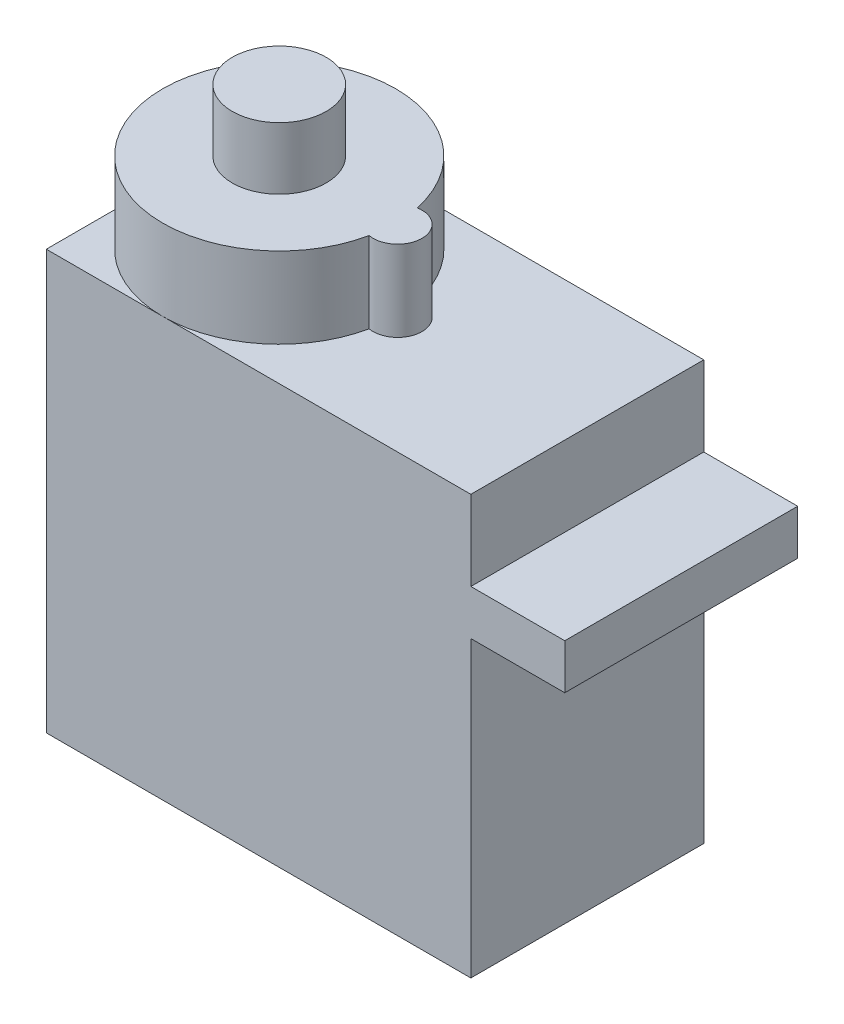
ISO-10303-21;
HEADER;
FILE_DESCRIPTION(('STEP AP214'),'2;1');
FILE_NAME('part.step','',(''),(''),'','','');
FILE_SCHEMA(('AUTOMOTIVE_DESIGN { 1 0 10303 214 1 1 1 1 }'));
ENDSEC;
DATA;
#1=APPLICATION_CONTEXT('core data for automotive mechanical design processes');
#2=APPLICATION_PROTOCOL_DEFINITION('international standard','automotive_design',2000,#1);
#3=PRODUCT_CONTEXT('',#1,'mechanical');
#4=PRODUCT('Part','Part','',(#3));
#5=PRODUCT_RELATED_PRODUCT_CATEGORY('part','',(#4));
#6=PRODUCT_DEFINITION_FORMATION('','',#4);
#7=PRODUCT_DEFINITION_CONTEXT('part definition',#1,'design');
#8=PRODUCT_DEFINITION('design','',#6,#7);
#9=PRODUCT_DEFINITION_SHAPE('','',#8);
#10=(LENGTH_UNIT() NAMED_UNIT(*) SI_UNIT(.MILLI.,.METRE.));
#11=(NAMED_UNIT(*) PLANE_ANGLE_UNIT() SI_UNIT($,.RADIAN.));
#12=(NAMED_UNIT(*) SI_UNIT($,.STERADIAN.) SOLID_ANGLE_UNIT());
#13=UNCERTAINTY_MEASURE_WITH_UNIT(LENGTH_MEASURE(1.E-05),#10,'distance_accuracy_value','');
#14=(GEOMETRIC_REPRESENTATION_CONTEXT(3) GLOBAL_UNCERTAINTY_ASSIGNED_CONTEXT((#13)) GLOBAL_UNIT_ASSIGNED_CONTEXT((#10,
#11,#12)) REPRESENTATION_CONTEXT('',''));
#15=CARTESIAN_POINT('',(0.,0.,0.));
#16=DIRECTION('',(0.,0.,1.));
#17=DIRECTION('',(1.,0.,0.));
#18=AXIS2_PLACEMENT_3D('',#15,#16,#17);
#19=CARTESIAN_POINT('',(0.,22.3,0.));
#20=DIRECTION('',(0.,-1.,0.));
#21=DIRECTION('',(0.,0.,-1.));
#22=AXIS2_PLACEMENT_3D('',#19,#20,#21);
#23=PLANE('',#22);
#24=CARTESIAN_POINT('',(1.2,22.3,0.));
#25=DIRECTION('',(0.,1.,0.));
#26=DIRECTION('',(0.,0.,1.));
#27=AXIS2_PLACEMENT_3D('',#24,#25,#26);
#28=CIRCLE('',#27,1.3);
#29=CARTESIAN_POINT('',(0.966666666666667,22.3,1.27888840621673));
#30=VERTEX_POINT('',#29);
#31=CARTESIAN_POINT('',(0.966666666666667,22.3,-1.27888840621673));
#32=VERTEX_POINT('',#31);
#33=EDGE_CURVE('E140',#30,#32,#28,.T.);
#34=ORIENTED_EDGE('',*,*,#33,.F.);
#35=CARTESIAN_POINT('',(-5.1,22.3,0.));
#36=DIRECTION('',(0.,1.,0.));
#37=DIRECTION('',(0.,0.,1.));
#38=AXIS2_PLACEMENT_3D('',#35,#36,#37);
#39=CIRCLE('',#38,6.2);
#40=CARTESIAN_POINT('',(-5.1,22.3,6.2));
#41=VERTEX_POINT('',#40);
#42=EDGE_CURVE('E60',#41,#30,#39,.T.);
#43=ORIENTED_EDGE('',*,*,#42,.F.);
#44=DIRECTION('',(1.,0.,0.));
#45=VECTOR('',#44,1.);
#46=CARTESIAN_POINT('',(-11.3,22.3,6.2));
#47=LINE('',#46,#45);
#48=CARTESIAN_POINT('',(11.3,22.3,6.2));
#49=VERTEX_POINT('',#48);
#50=EDGE_CURVE('E184',#41,#49,#47,.T.);
#51=ORIENTED_EDGE('',*,*,#50,.T.);
#52=DIRECTION('',(0.,0.,-1.));
#53=VECTOR('',#52,1.);
#54=CARTESIAN_POINT('',(11.3,22.3,6.2));
#55=LINE('',#54,#53);
#56=CARTESIAN_POINT('',(11.3,22.3,-6.2));
#57=VERTEX_POINT('',#56);
#58=EDGE_CURVE('E173',#49,#57,#55,.T.);
#59=ORIENTED_EDGE('',*,*,#58,.T.);
#60=DIRECTION('',(-1.,0.,0.));
#61=VECTOR('',#60,1.);
#62=CARTESIAN_POINT('',(-11.3,22.3,-6.2));
#63=LINE('',#62,#61);
#64=CARTESIAN_POINT('',(-5.1,22.3,-6.2));
#65=VERTEX_POINT('',#64);
#66=EDGE_CURVE('E178',#57,#65,#63,.T.);
#67=ORIENTED_EDGE('',*,*,#66,.T.);
#68=EDGE_CURVE('E54',#32,#65,#39,.T.);
#69=ORIENTED_EDGE('',*,*,#68,.F.);
#70=EDGE_LOOP('',(#34,#43,#51,#59,#67,#69));
#71=FACE_BOUND('',#70,.T.);
#72=ADVANCED_FACE('F37',(#71),#23,.F.);
#73=CARTESIAN_POINT('',(-11.3,22.3,0.));
#74=VERTEX_POINT('',#73);
#75=EDGE_CURVE('E46',#65,#74,#39,.T.);
#76=ORIENTED_EDGE('',*,*,#75,.F.);
#77=CARTESIAN_POINT('',(-11.3,22.3,-6.2));
#78=VERTEX_POINT('',#77);
#79=EDGE_CURVE('E176',#65,#78,#63,.T.);
#80=ORIENTED_EDGE('',*,*,#79,.T.);
#81=DIRECTION('',(0.,0.,1.));
#82=VECTOR('',#81,1.);
#83=CARTESIAN_POINT('',(-11.3,22.3,6.2));
#84=LINE('',#83,#82);
#85=EDGE_CURVE('E181',#78,#74,#84,.T.);
#86=ORIENTED_EDGE('',*,*,#85,.T.);
#87=EDGE_LOOP('',(#76,#80,#86));
#88=FACE_BOUND('',#87,.T.);
#89=ADVANCED_FACE('F220',(#88),#23,.F.);
#90=CARTESIAN_POINT('',(11.3,22.3,6.2));
#91=DIRECTION('',(-1.,0.,0.));
#92=DIRECTION('',(0.,0.,1.));
#93=AXIS2_PLACEMENT_3D('',#90,#91,#92);
#94=PLANE('',#93);
#95=DIRECTION('',(0.,0.,1.));
#96=VECTOR('',#95,1.);
#97=CARTESIAN_POINT('',(11.3,18.05,6.2));
#98=LINE('',#97,#96);
#99=CARTESIAN_POINT('',(11.3,18.05,-6.2));
#100=VERTEX_POINT('',#99);
#101=CARTESIAN_POINT('',(11.3,18.05,6.2));
#102=VERTEX_POINT('',#101);
#103=EDGE_CURVE('E144',#100,#102,#98,.T.);
#104=ORIENTED_EDGE('',*,*,#103,.F.);
#105=DIRECTION('',(0.,-1.,0.));
#106=VECTOR('',#105,1.);
#107=CARTESIAN_POINT('',(11.3,22.3,-6.2));
#108=LINE('',#107,#106);
#109=EDGE_CURVE('E41',#57,#100,#108,.T.);
#110=ORIENTED_EDGE('',*,*,#109,.F.);
#111=ORIENTED_EDGE('',*,*,#58,.F.);
#112=DIRECTION('',(0.,-1.,0.));
#113=VECTOR('',#112,1.);
#114=CARTESIAN_POINT('',(11.3,22.3,6.2));
#115=LINE('',#114,#113);
#116=EDGE_CURVE('E197',#49,#102,#115,.T.);
#117=ORIENTED_EDGE('',*,*,#116,.T.);
#118=EDGE_LOOP('',(#104,#110,#111,#117));
#119=FACE_BOUND('',#118,.T.);
#120=ADVANCED_FACE('F39',(#119),#94,.F.);
#121=DIRECTION('',(0.,0.,-1.));
#122=VECTOR('',#121,1.);
#123=CARTESIAN_POINT('',(11.3,15.65,6.2));
#124=LINE('',#123,#122);
#125=CARTESIAN_POINT('',(11.3,15.65,6.2));
#126=VERTEX_POINT('',#125);
#127=CARTESIAN_POINT('',(11.3,15.65,-6.2));
#128=VERTEX_POINT('',#127);
#129=EDGE_CURVE('E141',#126,#128,#124,.T.);
#130=ORIENTED_EDGE('',*,*,#129,.F.);
#131=CARTESIAN_POINT('',(11.3,0.,6.2));
#132=VERTEX_POINT('',#131);
#133=EDGE_CURVE('E188',#126,#132,#115,.T.);
#134=ORIENTED_EDGE('',*,*,#133,.T.);
#135=DIRECTION('',(0.,0.,-1.));
#136=VECTOR('',#135,1.);
#137=CARTESIAN_POINT('',(11.3,0.,6.2));
#138=LINE('',#137,#136);
#139=CARTESIAN_POINT('',(11.3,0.,-6.2));
#140=VERTEX_POINT('',#139);
#141=EDGE_CURVE('E172',#132,#140,#138,.T.);
#142=ORIENTED_EDGE('',*,*,#141,.T.);
#143=EDGE_CURVE('E203',#128,#140,#108,.T.);
#144=ORIENTED_EDGE('',*,*,#143,.F.);
#145=EDGE_LOOP('',(#130,#134,#142,#144));
#146=FACE_BOUND('',#145,.T.);
#147=ADVANCED_FACE('F241',(#146),#94,.F.);
#148=CARTESIAN_POINT('',(-11.3,22.3,-6.2));
#149=DIRECTION('',(0.,0.,1.));
#150=DIRECTION('',(1.,0.,0.));
#151=AXIS2_PLACEMENT_3D('',#148,#149,#150);
#152=PLANE('',#151);
#153=DIRECTION('',(-1.,0.,0.));
#154=VECTOR('',#153,1.);
#155=CARTESIAN_POINT('',(-11.3,0.,-6.2));
#156=LINE('',#155,#154);
#157=CARTESIAN_POINT('',(-11.3,0.,-6.2));
#158=VERTEX_POINT('',#157);
#159=EDGE_CURVE('E191',#140,#158,#156,.T.);
#160=ORIENTED_EDGE('',*,*,#159,.T.);
#161=DIRECTION('',(0.,-1.,0.));
#162=VECTOR('',#161,1.);
#163=CARTESIAN_POINT('',(-11.3,22.3,-6.2));
#164=LINE('',#163,#162);
#165=EDGE_CURVE('E201',#78,#158,#164,.T.);
#166=ORIENTED_EDGE('',*,*,#165,.F.);
#167=ORIENTED_EDGE('',*,*,#79,.F.);
#168=ORIENTED_EDGE('',*,*,#66,.F.);
#169=ORIENTED_EDGE('',*,*,#109,.T.);
#170=DIRECTION('',(-1.,0.,0.));
#171=VECTOR('',#170,1.);
#172=CARTESIAN_POINT('',(16.3,18.05,-6.2));
#173=LINE('',#172,#171);
#174=CARTESIAN_POINT('',(16.3,18.05,-6.2));
#175=VERTEX_POINT('',#174);
#176=EDGE_CURVE('E163',#175,#100,#173,.T.);
#177=ORIENTED_EDGE('',*,*,#176,.F.);
#178=DIRECTION('',(0.,1.,0.));
#179=VECTOR('',#178,1.);
#180=CARTESIAN_POINT('',(16.3,18.05,-6.2));
#181=LINE('',#180,#179);
#182=CARTESIAN_POINT('',(16.3,15.65,-6.2));
#183=VERTEX_POINT('',#182);
#184=EDGE_CURVE('E154',#183,#175,#181,.T.);
#185=ORIENTED_EDGE('',*,*,#184,.F.);
#186=DIRECTION('',(-1.,0.,0.));
#187=VECTOR('',#186,1.);
#188=CARTESIAN_POINT('',(16.3,15.65,-6.2));
#189=LINE('',#188,#187);
#190=EDGE_CURVE('E166',#183,#128,#189,.T.);
#191=ORIENTED_EDGE('',*,*,#190,.T.);
#192=ORIENTED_EDGE('',*,*,#143,.T.);
#193=EDGE_LOOP('',(#160,#166,#167,#168,#169,#177,#185,#191,#192));
#194=FACE_BOUND('',#193,.T.);
#195=ADVANCED_FACE('F221',(#194),#152,.F.);
#196=CARTESIAN_POINT('',(-11.3,22.3,6.2));
#197=DIRECTION('',(1.,0.,0.));
#198=DIRECTION('',(0.,0.,-1.));
#199=AXIS2_PLACEMENT_3D('',#196,#197,#198);
#200=PLANE('',#199);
#201=DIRECTION('',(0.,0.,1.));
#202=VECTOR('',#201,1.);
#203=CARTESIAN_POINT('',(-11.3,0.,6.2));
#204=LINE('',#203,#202);
#205=CARTESIAN_POINT('',(-11.3,0.,6.2));
#206=VERTEX_POINT('',#205);
#207=EDGE_CURVE('E193',#158,#206,#204,.T.);
#208=ORIENTED_EDGE('',*,*,#207,.T.);
#209=DIRECTION('',(0.,-1.,0.));
#210=VECTOR('',#209,1.);
#211=CARTESIAN_POINT('',(-11.3,22.3,6.2));
#212=LINE('',#211,#210);
#213=CARTESIAN_POINT('',(-11.3,22.3,6.2));
#214=VERTEX_POINT('',#213);
#215=EDGE_CURVE('E199',#214,#206,#212,.T.);
#216=ORIENTED_EDGE('',*,*,#215,.F.);
#217=EDGE_CURVE('E180',#74,#214,#84,.T.);
#218=ORIENTED_EDGE('',*,*,#217,.F.);
#219=ORIENTED_EDGE('',*,*,#85,.F.);
#220=ORIENTED_EDGE('',*,*,#165,.T.);
#221=EDGE_LOOP('',(#208,#216,#218,#219,#220));
#222=FACE_BOUND('',#221,.T.);
#223=ADVANCED_FACE('F248',(#222),#200,.F.);
#224=CARTESIAN_POINT('',(-11.3,22.3,6.2));
#225=DIRECTION('',(0.,0.,-1.));
#226=DIRECTION('',(-1.,0.,0.));
#227=AXIS2_PLACEMENT_3D('',#224,#225,#226);
#228=PLANE('',#227);
#229=DIRECTION('',(1.,0.,0.));
#230=VECTOR('',#229,1.);
#231=CARTESIAN_POINT('',(-11.3,0.,6.2));
#232=LINE('',#231,#230);
#233=EDGE_CURVE('E177',#206,#132,#232,.T.);
#234=ORIENTED_EDGE('',*,*,#233,.T.);
#235=ORIENTED_EDGE('',*,*,#133,.F.);
#236=DIRECTION('',(-1.,0.,0.));
#237=VECTOR('',#236,1.);
#238=CARTESIAN_POINT('',(16.3,15.65,6.2));
#239=LINE('',#238,#237);
#240=CARTESIAN_POINT('',(16.3,15.65,6.2));
#241=VERTEX_POINT('',#240);
#242=EDGE_CURVE('E169',#241,#126,#239,.T.);
#243=ORIENTED_EDGE('',*,*,#242,.F.);
#244=DIRECTION('',(0.,-1.,0.));
#245=VECTOR('',#244,1.);
#246=CARTESIAN_POINT('',(16.3,18.05,6.2));
#247=LINE('',#246,#245);
#248=CARTESIAN_POINT('',(16.3,18.05,6.2));
#249=VERTEX_POINT('',#248);
#250=EDGE_CURVE('E149',#249,#241,#247,.T.);
#251=ORIENTED_EDGE('',*,*,#250,.F.);
#252=DIRECTION('',(-1.,0.,0.));
#253=VECTOR('',#252,1.);
#254=CARTESIAN_POINT('',(16.3,18.05,6.2));
#255=LINE('',#254,#253);
#256=EDGE_CURVE('E157',#249,#102,#255,.T.);
#257=ORIENTED_EDGE('',*,*,#256,.T.);
#258=ORIENTED_EDGE('',*,*,#116,.F.);
#259=ORIENTED_EDGE('',*,*,#50,.F.);
#260=EDGE_CURVE('E185',#214,#41,#47,.T.);
#261=ORIENTED_EDGE('',*,*,#260,.F.);
#262=ORIENTED_EDGE('',*,*,#215,.T.);
#263=EDGE_LOOP('',(#234,#235,#243,#251,#257,#258,#259,#261,#262));
#264=FACE_BOUND('',#263,.T.);
#265=ADVANCED_FACE('F231',(#264),#228,.F.);
#266=EDGE_CURVE('E213',#74,#41,#39,.T.);
#267=ORIENTED_EDGE('',*,*,#266,.F.);
#268=ORIENTED_EDGE('',*,*,#217,.T.);
#269=ORIENTED_EDGE('',*,*,#260,.T.);
#270=EDGE_LOOP('',(#267,#268,#269));
#271=FACE_BOUND('',#270,.T.);
#272=ADVANCED_FACE('F251',(#271),#23,.F.);
#273=CARTESIAN_POINT('',(0.,0.,0.));
#274=DIRECTION('',(0.,-1.,0.));
#275=DIRECTION('',(0.,0.,-1.));
#276=AXIS2_PLACEMENT_3D('',#273,#274,#275);
#277=PLANE('',#276);
#278=ORIENTED_EDGE('',*,*,#141,.F.);
#279=ORIENTED_EDGE('',*,*,#233,.F.);
#280=ORIENTED_EDGE('',*,*,#207,.F.);
#281=ORIENTED_EDGE('',*,*,#159,.F.);
#282=EDGE_LOOP('',(#278,#279,#280,#281));
#283=FACE_BOUND('',#282,.T.);
#284=ADVANCED_FACE('F247',(#283),#277,.T.);
#285=CARTESIAN_POINT('',(16.3,15.65,6.2));
#286=DIRECTION('',(0.,1.,0.));
#287=DIRECTION('',(0.,0.,1.));
#288=AXIS2_PLACEMENT_3D('',#285,#286,#287);
#289=PLANE('',#288);
#290=ORIENTED_EDGE('',*,*,#129,.T.);
#291=ORIENTED_EDGE('',*,*,#190,.F.);
#292=DIRECTION('',(0.,0.,-1.));
#293=VECTOR('',#292,1.);
#294=CARTESIAN_POINT('',(16.3,15.65,6.2));
#295=LINE('',#294,#293);
#296=EDGE_CURVE('E152',#241,#183,#295,.T.);
#297=ORIENTED_EDGE('',*,*,#296,.F.);
#298=ORIENTED_EDGE('',*,*,#242,.T.);
#299=EDGE_LOOP('',(#290,#291,#297,#298));
#300=FACE_BOUND('',#299,.T.);
#301=ADVANCED_FACE('F239',(#300),#289,.F.);
#302=CARTESIAN_POINT('',(16.3,18.05,6.2));
#303=DIRECTION('',(0.,-1.,0.));
#304=DIRECTION('',(0.,0.,-1.));
#305=AXIS2_PLACEMENT_3D('',#302,#303,#304);
#306=PLANE('',#305);
#307=ORIENTED_EDGE('',*,*,#103,.T.);
#308=ORIENTED_EDGE('',*,*,#256,.F.);
#309=DIRECTION('',(0.,0.,1.));
#310=VECTOR('',#309,1.);
#311=CARTESIAN_POINT('',(16.3,18.05,6.2));
#312=LINE('',#311,#310);
#313=EDGE_CURVE('E156',#175,#249,#312,.T.);
#314=ORIENTED_EDGE('',*,*,#313,.F.);
#315=ORIENTED_EDGE('',*,*,#176,.T.);
#316=EDGE_LOOP('',(#307,#308,#314,#315));
#317=FACE_BOUND('',#316,.T.);
#318=ADVANCED_FACE('F227',(#317),#306,.F.);
#319=CARTESIAN_POINT('',(16.3,0.,0.));
#320=DIRECTION('',(1.,0.,0.));
#321=DIRECTION('',(0.,0.,-1.));
#322=AXIS2_PLACEMENT_3D('',#319,#320,#321);
#323=PLANE('',#322);
#324=ORIENTED_EDGE('',*,*,#250,.T.);
#325=ORIENTED_EDGE('',*,*,#296,.T.);
#326=ORIENTED_EDGE('',*,*,#184,.T.);
#327=ORIENTED_EDGE('',*,*,#313,.T.);
#328=EDGE_LOOP('',(#324,#325,#326,#327));
#329=FACE_BOUND('',#328,.T.);
#330=ADVANCED_FACE('F235',(#329),#323,.T.);
#331=CARTESIAN_POINT('',(1.2,26.6,0.));
#332=DIRECTION('',(0.,-1.,0.));
#333=DIRECTION('',(0.,0.,-1.));
#334=AXIS2_PLACEMENT_3D('',#331,#332,#333);
#335=CYLINDRICAL_SURFACE('',#334,1.3);
#336=ORIENTED_EDGE('',*,*,#33,.T.);
#337=DIRECTION('',(0.,-1.,0.));
#338=VECTOR('',#337,1.);
#339=CARTESIAN_POINT('',(0.966666666666667,26.6,-1.27888840621673));
#340=LINE('',#339,#338);
#341=CARTESIAN_POINT('',(0.966666666666667,26.6,-1.27888840621673));
#342=VERTEX_POINT('',#341);
#343=EDGE_CURVE('E128',#342,#32,#340,.T.);
#344=ORIENTED_EDGE('',*,*,#343,.F.);
#345=CARTESIAN_POINT('',(1.2,26.6,0.));
#346=DIRECTION('',(0.,1.,0.));
#347=DIRECTION('',(0.,0.,1.));
#348=AXIS2_PLACEMENT_3D('',#345,#346,#347);
#349=CIRCLE('',#348,1.3);
#350=CARTESIAN_POINT('',(0.966666666666667,26.6,1.27888840621673));
#351=VERTEX_POINT('',#350);
#352=EDGE_CURVE('E134',#351,#342,#349,.T.);
#353=ORIENTED_EDGE('',*,*,#352,.F.);
#354=DIRECTION('',(0.,-1.,0.));
#355=VECTOR('',#354,1.);
#356=CARTESIAN_POINT('',(0.966666666666667,26.6,1.27888840621673));
#357=LINE('',#356,#355);
#358=EDGE_CURVE('E131',#351,#30,#357,.T.);
#359=ORIENTED_EDGE('',*,*,#358,.T.);
#360=EDGE_LOOP('',(#336,#344,#353,#359));
#361=FACE_BOUND('',#360,.T.);
#362=ADVANCED_FACE('F139',(#361),#335,.T.);
#363=CARTESIAN_POINT('',(-5.1,26.6,0.));
#364=DIRECTION('',(0.,-1.,0.));
#365=DIRECTION('',(0.,0.,-1.));
#366=AXIS2_PLACEMENT_3D('',#363,#364,#365);
#367=CYLINDRICAL_SURFACE('',#366,6.2);
#368=ORIENTED_EDGE('',*,*,#68,.T.);
#369=ORIENTED_EDGE('',*,*,#75,.T.);
#370=ORIENTED_EDGE('',*,*,#266,.T.);
#371=ORIENTED_EDGE('',*,*,#42,.T.);
#372=ORIENTED_EDGE('',*,*,#358,.F.);
#373=CARTESIAN_POINT('',(-5.1,26.6,0.));
#374=DIRECTION('',(0.,1.,0.));
#375=DIRECTION('',(0.,0.,1.));
#376=AXIS2_PLACEMENT_3D('',#373,#374,#375);
#377=CIRCLE('',#376,6.2);
#378=EDGE_CURVE('E124',#342,#351,#377,.T.);
#379=ORIENTED_EDGE('',*,*,#378,.F.);
#380=ORIENTED_EDGE('',*,*,#343,.T.);
#381=EDGE_LOOP('',(#368,#369,#370,#371,#372,#379,#380));
#382=FACE_BOUND('',#381,.T.);
#383=ADVANCED_FACE('F126',(#382),#367,.T.);
#384=CARTESIAN_POINT('',(0.,26.6,0.));
#385=DIRECTION('',(0.,1.,0.));
#386=DIRECTION('',(0.,0.,1.));
#387=AXIS2_PLACEMENT_3D('',#384,#385,#386);
#388=PLANE('',#387);
#389=CARTESIAN_POINT('',(-5.1,26.6,0.));
#390=DIRECTION('',(0.,1.,0.));
#391=DIRECTION('',(0.,0.,1.));
#392=AXIS2_PLACEMENT_3D('',#389,#390,#391);
#393=CIRCLE('',#392,2.5);
#394=CARTESIAN_POINT('',(-5.1,26.6,2.5));
#395=VERTEX_POINT('',#394);
#396=EDGE_CURVE('E11',#395,#395,#393,.T.);
#397=ORIENTED_EDGE('',*,*,#396,.F.);
#398=EDGE_LOOP('',(#397));
#399=FACE_BOUND('',#398,.T.);
#400=ORIENTED_EDGE('',*,*,#352,.T.);
#401=ORIENTED_EDGE('',*,*,#378,.T.);
#402=EDGE_LOOP('',(#400,#401));
#403=FACE_BOUND('',#402,.T.);
#404=ADVANCED_FACE('F136',(#399,#403),#388,.T.);
#405=CARTESIAN_POINT('',(-5.1,29.9,0.));
#406=DIRECTION('',(0.,-1.,0.));
#407=DIRECTION('',(0.,0.,-1.));
#408=AXIS2_PLACEMENT_3D('',#405,#406,#407);
#409=CYLINDRICAL_SURFACE('',#408,2.5);
#410=CARTESIAN_POINT('',(-5.1,29.9,0.));
#411=DIRECTION('',(0.,1.,0.));
#412=DIRECTION('',(0.,0.,1.));
#413=AXIS2_PLACEMENT_3D('',#410,#411,#412);
#414=CIRCLE('',#413,2.5);
#415=CARTESIAN_POINT('',(-5.1,29.9,2.5));
#416=VERTEX_POINT('',#415);
#417=EDGE_CURVE('E217',#416,#416,#414,.T.);
#418=ORIENTED_EDGE('',*,*,#417,.F.);
#419=EDGE_LOOP('',(#418));
#420=FACE_BOUND('',#419,.T.);
#421=ORIENTED_EDGE('',*,*,#396,.T.);
#422=EDGE_LOOP('',(#421));
#423=FACE_BOUND('',#422,.T.);
#424=ADVANCED_FACE('F317',(#420,#423),#409,.T.);
#425=CARTESIAN_POINT('',(-5.1,29.9,0.));
#426=DIRECTION('',(0.,1.,0.));
#427=DIRECTION('',(0.,0.,1.));
#428=AXIS2_PLACEMENT_3D('',#425,#426,#427);
#429=PLANE('',#428);
#430=ORIENTED_EDGE('',*,*,#417,.T.);
#431=EDGE_LOOP('',(#430));
#432=FACE_BOUND('',#431,.T.);
#433=ADVANCED_FACE('F327',(#432),#429,.T.);
#434=CLOSED_SHELL('',(#72,#89,#120,#147,#195,#223,#265,#272,#284,#301,#318,#330,#362,#383,#404,
#424,#433));
#435=MANIFOLD_SOLID_BREP('B2',#434);
#436=ADVANCED_BREP_SHAPE_REPRESENTATION('',(#18,#435),#14);
#437=SHAPE_DEFINITION_REPRESENTATION(#9,#436);
ENDSEC;
END-ISO-10303-21;
